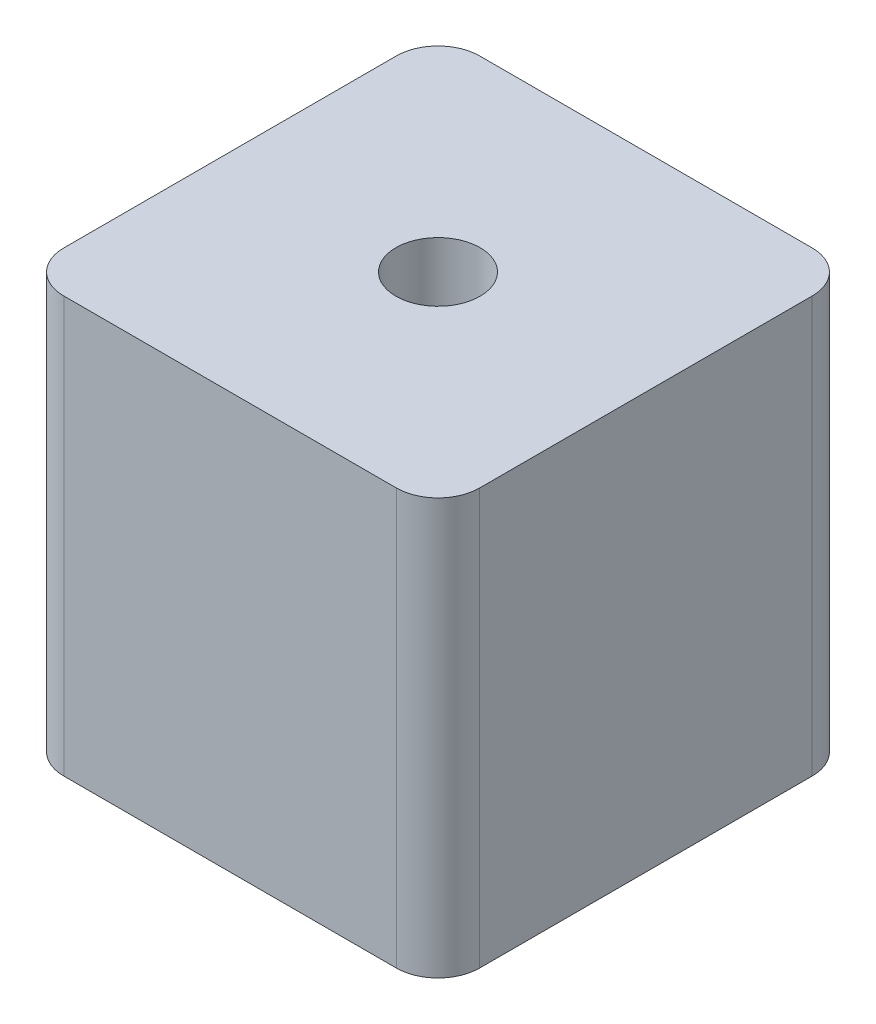
ISO-10303-21;
HEADER;
FILE_DESCRIPTION(('STEP AP214'),'2;1');
FILE_NAME('part.step','',(''),(''),'','','');
FILE_SCHEMA(('AUTOMOTIVE_DESIGN { 1 0 10303 214 1 1 1 1 }'));
ENDSEC;
DATA;
#1=APPLICATION_CONTEXT('core data for automotive mechanical design processes');
#2=APPLICATION_PROTOCOL_DEFINITION('international standard','automotive_design',2000,#1);
#3=PRODUCT_CONTEXT('',#1,'mechanical');
#4=PRODUCT('Part','Part','',(#3));
#5=PRODUCT_RELATED_PRODUCT_CATEGORY('part','',(#4));
#6=PRODUCT_DEFINITION_FORMATION('','',#4);
#7=PRODUCT_DEFINITION_CONTEXT('part definition',#1,'design');
#8=PRODUCT_DEFINITION('design','',#6,#7);
#9=PRODUCT_DEFINITION_SHAPE('','',#8);
#10=(LENGTH_UNIT() NAMED_UNIT(*) SI_UNIT(.MILLI.,.METRE.));
#11=(NAMED_UNIT(*) PLANE_ANGLE_UNIT() SI_UNIT($,.RADIAN.));
#12=(NAMED_UNIT(*) SI_UNIT($,.STERADIAN.) SOLID_ANGLE_UNIT());
#13=UNCERTAINTY_MEASURE_WITH_UNIT(LENGTH_MEASURE(1.E-05),#10,'distance_accuracy_value','');
#14=(GEOMETRIC_REPRESENTATION_CONTEXT(3) GLOBAL_UNCERTAINTY_ASSIGNED_CONTEXT((#13)) GLOBAL_UNIT_ASSIGNED_CONTEXT((#10,
#11,#12)) REPRESENTATION_CONTEXT('',''));
#15=CARTESIAN_POINT('',(0.,0.,0.));
#16=DIRECTION('',(0.,0.,1.));
#17=DIRECTION('',(1.,0.,0.));
#18=AXIS2_PLACEMENT_3D('',#15,#16,#17);
#19=CARTESIAN_POINT('',(10.,20.,10.));
#20=DIRECTION('',(-1.,0.,0.));
#21=DIRECTION('',(0.,0.,1.));
#22=AXIS2_PLACEMENT_3D('',#19,#20,#21);
#23=PLANE('',#22);
#24=DIRECTION('',(0.,0.,-1.));
#25=VECTOR('',#24,1.);
#26=CARTESIAN_POINT('',(10.,0.,10.));
#27=LINE('',#26,#25);
#28=CARTESIAN_POINT('',(10.,0.,8.));
#29=VERTEX_POINT('',#28);
#30=CARTESIAN_POINT('',(10.,0.,-8.));
#31=VERTEX_POINT('',#30);
#32=EDGE_CURVE('E184',#29,#31,#27,.T.);
#33=ORIENTED_EDGE('',*,*,#32,.T.);
#34=DIRECTION('',(0.,-1.,0.));
#35=VECTOR('',#34,1.);
#36=CARTESIAN_POINT('',(10.,20.,-8.));
#37=LINE('',#36,#35);
#38=CARTESIAN_POINT('',(10.,20.,-8.));
#39=VERTEX_POINT('',#38);
#40=EDGE_CURVE('E11',#31,#39,#37,.F.);
#41=ORIENTED_EDGE('',*,*,#40,.T.);
#42=DIRECTION('',(0.,0.,-1.));
#43=VECTOR('',#42,1.);
#44=CARTESIAN_POINT('',(10.,20.,10.));
#45=LINE('',#44,#43);
#46=CARTESIAN_POINT('',(10.,20.,8.));
#47=VERTEX_POINT('',#46);
#48=EDGE_CURVE('E135',#47,#39,#45,.T.);
#49=ORIENTED_EDGE('',*,*,#48,.F.);
#50=DIRECTION('',(0.,-1.,0.));
#51=VECTOR('',#50,1.);
#52=CARTESIAN_POINT('',(10.,20.,8.));
#53=LINE('',#52,#51);
#54=EDGE_CURVE('E48',#47,#29,#53,.T.);
#55=ORIENTED_EDGE('',*,*,#54,.T.);
#56=EDGE_LOOP('',(#33,#41,#49,#55));
#57=FACE_BOUND('',#56,.T.);
#58=ADVANCED_FACE('F39',(#57),#23,.F.);
#59=CARTESIAN_POINT('',(-10.,20.,-10.));
#60=DIRECTION('',(0.,0.,1.));
#61=DIRECTION('',(1.,0.,0.));
#62=AXIS2_PLACEMENT_3D('',#59,#60,#61);
#63=PLANE('',#62);
#64=DIRECTION('',(-1.,0.,0.));
#65=VECTOR('',#64,1.);
#66=CARTESIAN_POINT('',(-10.,0.,-10.));
#67=LINE('',#66,#65);
#68=CARTESIAN_POINT('',(8.,0.,-10.));
#69=VERTEX_POINT('',#68);
#70=CARTESIAN_POINT('',(-8.,0.,-10.));
#71=VERTEX_POINT('',#70);
#72=EDGE_CURVE('E144',#69,#71,#67,.T.);
#73=ORIENTED_EDGE('',*,*,#72,.T.);
#74=DIRECTION('',(0.,-1.,0.));
#75=VECTOR('',#74,1.);
#76=CARTESIAN_POINT('',(-8.,20.,-10.));
#77=LINE('',#76,#75);
#78=CARTESIAN_POINT('',(-8.,20.,-10.));
#79=VERTEX_POINT('',#78);
#80=EDGE_CURVE('E55',#71,#79,#77,.F.);
#81=ORIENTED_EDGE('',*,*,#80,.T.);
#82=DIRECTION('',(-1.,0.,0.));
#83=VECTOR('',#82,1.);
#84=CARTESIAN_POINT('',(-10.,20.,-10.));
#85=LINE('',#84,#83);
#86=CARTESIAN_POINT('',(8.,20.,-10.));
#87=VERTEX_POINT('',#86);
#88=EDGE_CURVE('E141',#87,#79,#85,.T.);
#89=ORIENTED_EDGE('',*,*,#88,.F.);
#90=DIRECTION('',(0.,-1.,0.));
#91=VECTOR('',#90,1.);
#92=CARTESIAN_POINT('',(8.,20.,-10.));
#93=LINE('',#92,#91);
#94=EDGE_CURVE('E172',#87,#69,#93,.T.);
#95=ORIENTED_EDGE('',*,*,#94,.T.);
#96=EDGE_LOOP('',(#73,#81,#89,#95));
#97=FACE_BOUND('',#96,.T.);
#98=ADVANCED_FACE('F220',(#97),#63,.F.);
#99=CARTESIAN_POINT('',(-10.,20.,10.));
#100=DIRECTION('',(1.,0.,0.));
#101=DIRECTION('',(0.,0.,-1.));
#102=AXIS2_PLACEMENT_3D('',#99,#100,#101);
#103=PLANE('',#102);
#104=DIRECTION('',(0.,0.,1.));
#105=VECTOR('',#104,1.);
#106=CARTESIAN_POINT('',(-10.,0.,10.));
#107=LINE('',#106,#105);
#108=CARTESIAN_POINT('',(-10.,0.,-8.));
#109=VERTEX_POINT('',#108);
#110=CARTESIAN_POINT('',(-10.,0.,8.));
#111=VERTEX_POINT('',#110);
#112=EDGE_CURVE('E136',#109,#111,#107,.T.);
#113=ORIENTED_EDGE('',*,*,#112,.T.);
#114=DIRECTION('',(0.,-1.,0.));
#115=VECTOR('',#114,1.);
#116=CARTESIAN_POINT('',(-10.,20.,8.));
#117=LINE('',#116,#115);
#118=CARTESIAN_POINT('',(-10.,20.,8.));
#119=VERTEX_POINT('',#118);
#120=EDGE_CURVE('E111',#111,#119,#117,.F.);
#121=ORIENTED_EDGE('',*,*,#120,.T.);
#122=DIRECTION('',(0.,0.,1.));
#123=VECTOR('',#122,1.);
#124=CARTESIAN_POINT('',(-10.,20.,10.));
#125=LINE('',#124,#123);
#126=CARTESIAN_POINT('',(-10.,20.,-8.));
#127=VERTEX_POINT('',#126);
#128=EDGE_CURVE('E201',#127,#119,#125,.T.);
#129=ORIENTED_EDGE('',*,*,#128,.F.);
#130=DIRECTION('',(0.,-1.,0.));
#131=VECTOR('',#130,1.);
#132=CARTESIAN_POINT('',(-10.,20.,-8.));
#133=LINE('',#132,#131);
#134=EDGE_CURVE('E117',#127,#109,#133,.T.);
#135=ORIENTED_EDGE('',*,*,#134,.T.);
#136=EDGE_LOOP('',(#113,#121,#129,#135));
#137=FACE_BOUND('',#136,.T.);
#138=ADVANCED_FACE('F217',(#137),#103,.F.);
#139=CARTESIAN_POINT('',(-10.,20.,10.));
#140=DIRECTION('',(0.,0.,-1.));
#141=DIRECTION('',(-1.,0.,0.));
#142=AXIS2_PLACEMENT_3D('',#139,#140,#141);
#143=PLANE('',#142);
#144=DIRECTION('',(1.,0.,0.));
#145=VECTOR('',#144,1.);
#146=CARTESIAN_POINT('',(-10.,20.,10.));
#147=LINE('',#146,#145);
#148=CARTESIAN_POINT('',(-8.,20.,10.));
#149=VERTEX_POINT('',#148);
#150=CARTESIAN_POINT('',(8.,20.,10.));
#151=VERTEX_POINT('',#150);
#152=EDGE_CURVE('E127',#149,#151,#147,.T.);
#153=ORIENTED_EDGE('',*,*,#152,.F.);
#154=DIRECTION('',(0.,-1.,0.));
#155=VECTOR('',#154,1.);
#156=CARTESIAN_POINT('',(-8.,20.,10.));
#157=LINE('',#156,#155);
#158=CARTESIAN_POINT('',(-8.,0.,10.));
#159=VERTEX_POINT('',#158);
#160=EDGE_CURVE('E110',#149,#159,#157,.T.);
#161=ORIENTED_EDGE('',*,*,#160,.T.);
#162=DIRECTION('',(1.,0.,0.));
#163=VECTOR('',#162,1.);
#164=CARTESIAN_POINT('',(-10.,0.,10.));
#165=LINE('',#164,#163);
#166=CARTESIAN_POINT('',(8.,0.,10.));
#167=VERTEX_POINT('',#166);
#168=EDGE_CURVE('E124',#159,#167,#165,.T.);
#169=ORIENTED_EDGE('',*,*,#168,.T.);
#170=DIRECTION('',(0.,-1.,0.));
#171=VECTOR('',#170,1.);
#172=CARTESIAN_POINT('',(8.,20.,10.));
#173=LINE('',#172,#171);
#174=EDGE_CURVE('E130',#167,#151,#173,.F.);
#175=ORIENTED_EDGE('',*,*,#174,.T.);
#176=EDGE_LOOP('',(#153,#161,#169,#175));
#177=FACE_BOUND('',#176,.T.);
#178=ADVANCED_FACE('F123',(#177),#143,.F.);
#179=CARTESIAN_POINT('',(0.,20.,0.));
#180=DIRECTION('',(0.,-1.,0.));
#181=DIRECTION('',(0.,0.,-1.));
#182=AXIS2_PLACEMENT_3D('',#179,#180,#181);
#183=PLANE('',#182);
#184=CARTESIAN_POINT('',(0.,20.,0.));
#185=DIRECTION('',(0.,1.,0.));
#186=DIRECTION('',(0.,0.,1.));
#187=AXIS2_PLACEMENT_3D('',#184,#185,#186);
#188=CIRCLE('',#187,2.025);
#189=CARTESIAN_POINT('',(0.,20.,2.025));
#190=VERTEX_POINT('',#189);
#191=EDGE_CURVE('E196',#190,#190,#188,.T.);
#192=ORIENTED_EDGE('',*,*,#191,.F.);
#193=EDGE_LOOP('',(#192));
#194=FACE_BOUND('',#193,.T.);
#195=ORIENTED_EDGE('',*,*,#128,.T.);
#196=CARTESIAN_POINT('',(-8.,20.,8.));
#197=DIRECTION('',(0.,-1.,0.));
#198=DIRECTION('',(0.,0.,-1.));
#199=AXIS2_PLACEMENT_3D('',#196,#197,#198);
#200=CIRCLE('',#199,2.);
#201=EDGE_CURVE('E169',#119,#149,#200,.F.);
#202=ORIENTED_EDGE('',*,*,#201,.T.);
#203=ORIENTED_EDGE('',*,*,#152,.T.);
#204=CARTESIAN_POINT('',(8.,20.,8.));
#205=DIRECTION('',(0.,-1.,0.));
#206=DIRECTION('',(0.,0.,-1.));
#207=AXIS2_PLACEMENT_3D('',#204,#205,#206);
#208=CIRCLE('',#207,2.);
#209=EDGE_CURVE('E161',#151,#47,#208,.F.);
#210=ORIENTED_EDGE('',*,*,#209,.T.);
#211=ORIENTED_EDGE('',*,*,#48,.T.);
#212=CARTESIAN_POINT('',(8.,20.,-8.));
#213=DIRECTION('',(0.,-1.,0.));
#214=DIRECTION('',(0.,0.,-1.));
#215=AXIS2_PLACEMENT_3D('',#212,#213,#214);
#216=CIRCLE('',#215,2.);
#217=EDGE_CURVE('E62',#39,#87,#216,.F.);
#218=ORIENTED_EDGE('',*,*,#217,.T.);
#219=ORIENTED_EDGE('',*,*,#88,.T.);
#220=CARTESIAN_POINT('',(-8.,20.,-8.));
#221=DIRECTION('',(0.,-1.,0.));
#222=DIRECTION('',(0.,0.,-1.));
#223=AXIS2_PLACEMENT_3D('',#220,#221,#222);
#224=CIRCLE('',#223,2.);
#225=EDGE_CURVE('E166',#79,#127,#224,.F.);
#226=ORIENTED_EDGE('',*,*,#225,.T.);
#227=EDGE_LOOP('',(#195,#202,#203,#210,#211,#218,#219,#226));
#228=FACE_BOUND('',#227,.T.);
#229=ADVANCED_FACE('F210',(#194,#228),#183,.F.);
#230=CARTESIAN_POINT('',(0.,0.,0.));
#231=DIRECTION('',(0.,-1.,0.));
#232=DIRECTION('',(0.,0.,-1.));
#233=AXIS2_PLACEMENT_3D('',#230,#231,#232);
#234=PLANE('',#233);
#235=CARTESIAN_POINT('',(0.,0.,0.));
#236=DIRECTION('',(0.,1.,0.));
#237=DIRECTION('',(0.,0.,1.));
#238=AXIS2_PLACEMENT_3D('',#235,#236,#237);
#239=CIRCLE('',#238,2.025);
#240=CARTESIAN_POINT('',(0.,0.,2.025));
#241=VERTEX_POINT('',#240);
#242=EDGE_CURVE('E190',#241,#241,#239,.T.);
#243=ORIENTED_EDGE('',*,*,#242,.T.);
#244=EDGE_LOOP('',(#243));
#245=FACE_BOUND('',#244,.T.);
#246=ORIENTED_EDGE('',*,*,#168,.F.);
#247=CARTESIAN_POINT('',(-8.,0.,8.));
#248=DIRECTION('',(0.,-1.,0.));
#249=DIRECTION('',(0.,0.,-1.));
#250=AXIS2_PLACEMENT_3D('',#247,#248,#249);
#251=CIRCLE('',#250,2.);
#252=EDGE_CURVE('E106',#159,#111,#251,.T.);
#253=ORIENTED_EDGE('',*,*,#252,.T.);
#254=ORIENTED_EDGE('',*,*,#112,.F.);
#255=CARTESIAN_POINT('',(-8.,0.,-8.));
#256=DIRECTION('',(0.,-1.,0.));
#257=DIRECTION('',(0.,0.,-1.));
#258=AXIS2_PLACEMENT_3D('',#255,#256,#257);
#259=CIRCLE('',#258,2.);
#260=EDGE_CURVE('E118',#109,#71,#259,.T.);
#261=ORIENTED_EDGE('',*,*,#260,.T.);
#262=ORIENTED_EDGE('',*,*,#72,.F.);
#263=CARTESIAN_POINT('',(8.,0.,-8.));
#264=DIRECTION('',(0.,-1.,0.));
#265=DIRECTION('',(0.,0.,-1.));
#266=AXIS2_PLACEMENT_3D('',#263,#264,#265);
#267=CIRCLE('',#266,2.);
#268=EDGE_CURVE('E152',#69,#31,#267,.T.);
#269=ORIENTED_EDGE('',*,*,#268,.T.);
#270=ORIENTED_EDGE('',*,*,#32,.F.);
#271=CARTESIAN_POINT('',(8.,0.,8.));
#272=DIRECTION('',(0.,-1.,0.));
#273=DIRECTION('',(0.,0.,-1.));
#274=AXIS2_PLACEMENT_3D('',#271,#272,#273);
#275=CIRCLE('',#274,2.);
#276=EDGE_CURVE('E129',#29,#167,#275,.T.);
#277=ORIENTED_EDGE('',*,*,#276,.T.);
#278=EDGE_LOOP('',(#246,#253,#254,#261,#262,#269,#270,#277));
#279=FACE_BOUND('',#278,.T.);
#280=ADVANCED_FACE('F132',(#245,#279),#234,.T.);
#281=CARTESIAN_POINT('',(0.,0.,0.));
#282=DIRECTION('',(0.,1.,0.));
#283=DIRECTION('',(0.,0.,1.));
#284=AXIS2_PLACEMENT_3D('',#281,#282,#283);
#285=CYLINDRICAL_SURFACE('',#284,2.025);
#286=ORIENTED_EDGE('',*,*,#242,.F.);
#287=EDGE_LOOP('',(#286));
#288=FACE_BOUND('',#287,.T.);
#289=ORIENTED_EDGE('',*,*,#191,.T.);
#290=EDGE_LOOP('',(#289));
#291=FACE_BOUND('',#290,.T.);
#292=ADVANCED_FACE('F208',(#288,#291),#285,.F.);
#293=CARTESIAN_POINT('',(-8.,20.,8.));
#294=DIRECTION('',(0.,-1.,0.));
#295=DIRECTION('',(0.,0.,-1.));
#296=AXIS2_PLACEMENT_3D('',#293,#294,#295);
#297=CYLINDRICAL_SURFACE('',#296,2.);
#298=ORIENTED_EDGE('',*,*,#201,.F.);
#299=ORIENTED_EDGE('',*,*,#120,.F.);
#300=ORIENTED_EDGE('',*,*,#252,.F.);
#301=ORIENTED_EDGE('',*,*,#160,.F.);
#302=EDGE_LOOP('',(#298,#299,#300,#301));
#303=FACE_BOUND('',#302,.T.);
#304=ADVANCED_FACE('F109',(#303),#297,.T.);
#305=CARTESIAN_POINT('',(-8.,20.,-8.));
#306=DIRECTION('',(0.,-1.,0.));
#307=DIRECTION('',(0.,0.,-1.));
#308=AXIS2_PLACEMENT_3D('',#305,#306,#307);
#309=CYLINDRICAL_SURFACE('',#308,2.);
#310=ORIENTED_EDGE('',*,*,#225,.F.);
#311=ORIENTED_EDGE('',*,*,#80,.F.);
#312=ORIENTED_EDGE('',*,*,#260,.F.);
#313=ORIENTED_EDGE('',*,*,#134,.F.);
#314=EDGE_LOOP('',(#310,#311,#312,#313));
#315=FACE_BOUND('',#314,.T.);
#316=ADVANCED_FACE('F219',(#315),#309,.T.);
#317=CARTESIAN_POINT('',(8.,20.,-8.));
#318=DIRECTION('',(0.,-1.,0.));
#319=DIRECTION('',(0.,0.,-1.));
#320=AXIS2_PLACEMENT_3D('',#317,#318,#319);
#321=CYLINDRICAL_SURFACE('',#320,2.);
#322=ORIENTED_EDGE('',*,*,#217,.F.);
#323=ORIENTED_EDGE('',*,*,#40,.F.);
#324=ORIENTED_EDGE('',*,*,#268,.F.);
#325=ORIENTED_EDGE('',*,*,#94,.F.);
#326=EDGE_LOOP('',(#322,#323,#324,#325));
#327=FACE_BOUND('',#326,.T.);
#328=ADVANCED_FACE('F223',(#327),#321,.T.);
#329=CARTESIAN_POINT('',(8.,20.,8.));
#330=DIRECTION('',(0.,-1.,0.));
#331=DIRECTION('',(0.,0.,-1.));
#332=AXIS2_PLACEMENT_3D('',#329,#330,#331);
#333=CYLINDRICAL_SURFACE('',#332,2.);
#334=ORIENTED_EDGE('',*,*,#209,.F.);
#335=ORIENTED_EDGE('',*,*,#174,.F.);
#336=ORIENTED_EDGE('',*,*,#276,.F.);
#337=ORIENTED_EDGE('',*,*,#54,.F.);
#338=EDGE_LOOP('',(#334,#335,#336,#337));
#339=FACE_BOUND('',#338,.T.);
#340=ADVANCED_FACE('F41',(#339),#333,.T.);
#341=CLOSED_SHELL('',(#58,#98,#138,#178,#229,#280,#292,#304,#316,#328,#340));
#342=MANIFOLD_SOLID_BREP('B2',#341);
#343=ADVANCED_BREP_SHAPE_REPRESENTATION('',(#18,#342),#14);
#344=SHAPE_DEFINITION_REPRESENTATION(#9,#343);
ENDSEC;
END-ISO-10303-21;
